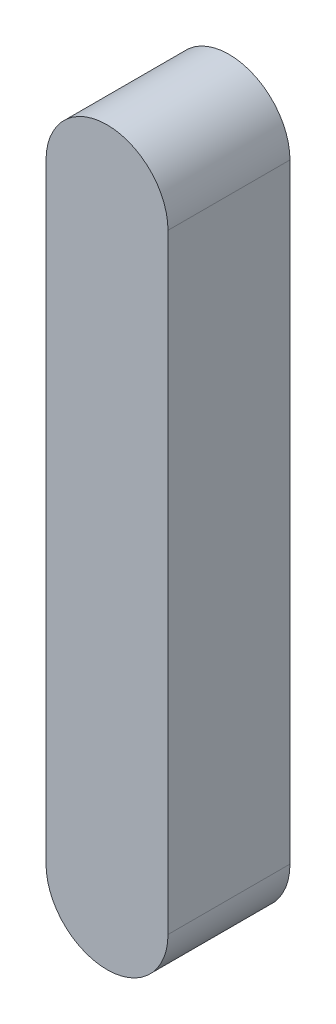
ISO-10303-21;
HEADER;
FILE_DESCRIPTION(('STEP AP214'),'2;1');
FILE_NAME('part.step','',(''),(''),'','','');
FILE_SCHEMA(('AUTOMOTIVE_DESIGN { 1 0 10303 214 1 1 1 1 }'));
ENDSEC;
DATA;
#1=APPLICATION_CONTEXT('core data for automotive mechanical design processes');
#2=APPLICATION_PROTOCOL_DEFINITION('international standard','automotive_design',2000,#1);
#3=PRODUCT_CONTEXT('',#1,'mechanical');
#4=PRODUCT('Part','Part','',(#3));
#5=PRODUCT_RELATED_PRODUCT_CATEGORY('part','',(#4));
#6=PRODUCT_DEFINITION_FORMATION('','',#4);
#7=PRODUCT_DEFINITION_CONTEXT('part definition',#1,'design');
#8=PRODUCT_DEFINITION('design','',#6,#7);
#9=PRODUCT_DEFINITION_SHAPE('','',#8);
#10=(LENGTH_UNIT() NAMED_UNIT(*) SI_UNIT(.MILLI.,.METRE.));
#11=(NAMED_UNIT(*) PLANE_ANGLE_UNIT() SI_UNIT($,.RADIAN.));
#12=(NAMED_UNIT(*) SI_UNIT($,.STERADIAN.) SOLID_ANGLE_UNIT());
#13=UNCERTAINTY_MEASURE_WITH_UNIT(LENGTH_MEASURE(1.E-05),#10,'distance_accuracy_value','');
#14=(GEOMETRIC_REPRESENTATION_CONTEXT(3) GLOBAL_UNCERTAINTY_ASSIGNED_CONTEXT((#13)) GLOBAL_UNIT_ASSIGNED_CONTEXT((#10,
#11,#12)) REPRESENTATION_CONTEXT('',''));
#15=CARTESIAN_POINT('',(0.,0.,0.));
#16=DIRECTION('',(0.,0.,1.));
#17=DIRECTION('',(1.,0.,0.));
#18=AXIS2_PLACEMENT_3D('',#15,#16,#17);
#19=CARTESIAN_POINT('',(0.,-5.000000033,-1.000000032));
#20=DIRECTION('',(0.,0.,1.));
#21=DIRECTION('',(1.,0.,0.));
#22=AXIS2_PLACEMENT_3D('',#19,#20,#21);
#23=PLANE('',#22);
#24=CARTESIAN_POINT('',(0.,-5.000000033,-1.000000032));
#25=DIRECTION('',(0.,0.,1.));
#26=DIRECTION('',(1.,0.,0.));
#27=AXIS2_PLACEMENT_3D('',#24,#25,#26);
#28=CIRCLE('',#27,1.000000032);
#29=CARTESIAN_POINT('',(-1.000000032,-5.000000033,-1.000000032));
#30=VERTEX_POINT('',#29);
#31=CARTESIAN_POINT('',(1.000000032,-5.000000033,-1.000000032));
#32=VERTEX_POINT('',#31);
#33=EDGE_CURVE('E115',#30,#32,#28,.T.);
#34=ORIENTED_EDGE('',*,*,#33,.F.);
#35=DIRECTION('',(0.,-1.,0.));
#36=VECTOR('',#35,1.);
#37=CARTESIAN_POINT('',(-1.000000032,-5.000000033,-1.000000032));
#38=LINE('',#37,#36);
#39=CARTESIAN_POINT('',(-1.000000032,5.000000033,-1.000000032));
#40=VERTEX_POINT('',#39);
#41=EDGE_CURVE('E26',#40,#30,#38,.T.);
#42=ORIENTED_EDGE('',*,*,#41,.F.);
#43=CARTESIAN_POINT('',(0.,5.000000033,-1.000000032));
#44=DIRECTION('',(0.,0.,1.));
#45=DIRECTION('',(1.,0.,0.));
#46=AXIS2_PLACEMENT_3D('',#43,#44,#45);
#47=CIRCLE('',#46,1.000000032);
#48=CARTESIAN_POINT('',(1.000000032,5.000000033,-1.000000032));
#49=VERTEX_POINT('',#48);
#50=EDGE_CURVE('E19',#49,#40,#47,.T.);
#51=ORIENTED_EDGE('',*,*,#50,.F.);
#52=DIRECTION('',(0.,1.,0.));
#53=VECTOR('',#52,1.);
#54=CARTESIAN_POINT('',(1.000000032,-5.000000033,-1.000000032));
#55=LINE('',#54,#53);
#56=EDGE_CURVE('E92',#32,#49,#55,.T.);
#57=ORIENTED_EDGE('',*,*,#56,.F.);
#58=EDGE_LOOP('',(#34,#42,#51,#57));
#59=FACE_BOUND('',#58,.T.);
#60=ADVANCED_FACE('F16',(#59),#23,.F.);
#61=CARTESIAN_POINT('',(0.,-5.000000033,1.000000032));
#62=DIRECTION('',(0.,0.,1.));
#63=DIRECTION('',(1.,0.,0.));
#64=AXIS2_PLACEMENT_3D('',#61,#62,#63);
#65=PLANE('',#64);
#66=CARTESIAN_POINT('',(0.,-5.000000033,1.000000032));
#67=DIRECTION('',(0.,0.,1.));
#68=DIRECTION('',(1.,0.,0.));
#69=AXIS2_PLACEMENT_3D('',#66,#67,#68);
#70=CIRCLE('',#69,1.000000032);
#71=CARTESIAN_POINT('',(-1.000000032,-5.000000033,1.000000032));
#72=VERTEX_POINT('',#71);
#73=CARTESIAN_POINT('',(1.000000032,-5.000000033,1.000000032));
#74=VERTEX_POINT('',#73);
#75=EDGE_CURVE('E87',#72,#74,#70,.T.);
#76=ORIENTED_EDGE('',*,*,#75,.T.);
#77=DIRECTION('',(0.,1.,0.));
#78=VECTOR('',#77,1.);
#79=CARTESIAN_POINT('',(1.000000032,-5.000000033,1.000000032));
#80=LINE('',#79,#78);
#81=CARTESIAN_POINT('',(1.000000032,5.000000033,1.000000032));
#82=VERTEX_POINT('',#81);
#83=EDGE_CURVE('E67',#74,#82,#80,.T.);
#84=ORIENTED_EDGE('',*,*,#83,.T.);
#85=CARTESIAN_POINT('',(0.,5.000000033,1.000000032));
#86=DIRECTION('',(0.,0.,1.));
#87=DIRECTION('',(1.,0.,0.));
#88=AXIS2_PLACEMENT_3D('',#85,#86,#87);
#89=CIRCLE('',#88,1.000000032);
#90=CARTESIAN_POINT('',(-1.000000032,5.000000033,1.000000032));
#91=VERTEX_POINT('',#90);
#92=EDGE_CURVE('E77',#82,#91,#89,.T.);
#93=ORIENTED_EDGE('',*,*,#92,.T.);
#94=DIRECTION('',(0.,-1.,0.));
#95=VECTOR('',#94,1.);
#96=CARTESIAN_POINT('',(-1.000000032,-5.000000033,1.000000032));
#97=LINE('',#96,#95);
#98=EDGE_CURVE('E11',#91,#72,#97,.T.);
#99=ORIENTED_EDGE('',*,*,#98,.T.);
#100=EDGE_LOOP('',(#76,#84,#93,#99));
#101=FACE_BOUND('',#100,.T.);
#102=ADVANCED_FACE('F85',(#101),#65,.T.);
#103=CARTESIAN_POINT('',(-1.000000032,-5.000000033,1.000000032));
#104=DIRECTION('',(1.,0.,0.));
#105=DIRECTION('',(0.,1.,0.));
#106=AXIS2_PLACEMENT_3D('',#103,#104,#105);
#107=PLANE('',#106);
#108=ORIENTED_EDGE('',*,*,#41,.T.);
#109=DIRECTION('',(0.,0.,-1.));
#110=VECTOR('',#109,1.);
#111=CARTESIAN_POINT('',(-1.000000032,-5.000000033,1.000000032));
#112=LINE('',#111,#110);
#113=EDGE_CURVE('E99',#72,#30,#112,.T.);
#114=ORIENTED_EDGE('',*,*,#113,.F.);
#115=ORIENTED_EDGE('',*,*,#98,.F.);
#116=DIRECTION('',(0.,0.,-1.));
#117=VECTOR('',#116,1.);
#118=CARTESIAN_POINT('',(-1.000000032,5.000000033,1.000000032));
#119=LINE('',#118,#117);
#120=EDGE_CURVE('E82',#91,#40,#119,.T.);
#121=ORIENTED_EDGE('',*,*,#120,.T.);
#122=EDGE_LOOP('',(#108,#114,#115,#121));
#123=FACE_BOUND('',#122,.T.);
#124=ADVANCED_FACE('F108',(#123),#107,.F.);
#125=CARTESIAN_POINT('',(0.,5.000000033,1.000000032));
#126=DIRECTION('',(0.,0.,-1.));
#127=DIRECTION('',(-1.,0.,0.));
#128=AXIS2_PLACEMENT_3D('',#125,#126,#127);
#129=CYLINDRICAL_SURFACE('',#128,1.000000032);
#130=ORIENTED_EDGE('',*,*,#50,.T.);
#131=ORIENTED_EDGE('',*,*,#120,.F.);
#132=ORIENTED_EDGE('',*,*,#92,.F.);
#133=DIRECTION('',(0.,0.,-1.));
#134=VECTOR('',#133,1.);
#135=CARTESIAN_POINT('',(1.000000032,5.000000033,1.000000032));
#136=LINE('',#135,#134);
#137=EDGE_CURVE('E80',#82,#49,#136,.T.);
#138=ORIENTED_EDGE('',*,*,#137,.T.);
#139=EDGE_LOOP('',(#130,#131,#132,#138));
#140=FACE_BOUND('',#139,.T.);
#141=ADVANCED_FACE('F79',(#140),#129,.T.);
#142=CARTESIAN_POINT('',(1.000000032,-5.000000033,1.000000032));
#143=DIRECTION('',(-1.,0.,0.));
#144=DIRECTION('',(0.,1.,0.));
#145=AXIS2_PLACEMENT_3D('',#142,#143,#144);
#146=PLANE('',#145);
#147=ORIENTED_EDGE('',*,*,#56,.T.);
#148=ORIENTED_EDGE('',*,*,#137,.F.);
#149=ORIENTED_EDGE('',*,*,#83,.F.);
#150=DIRECTION('',(0.,0.,-1.));
#151=VECTOR('',#150,1.);
#152=CARTESIAN_POINT('',(1.000000032,-5.000000033,1.000000032));
#153=LINE('',#152,#151);
#154=EDGE_CURVE('E119',#74,#32,#153,.T.);
#155=ORIENTED_EDGE('',*,*,#154,.T.);
#156=EDGE_LOOP('',(#147,#148,#149,#155));
#157=FACE_BOUND('',#156,.T.);
#158=ADVANCED_FACE('F91',(#157),#146,.F.);
#159=CARTESIAN_POINT('',(0.,-5.000000033,1.000000032));
#160=DIRECTION('',(0.,0.,-1.));
#161=DIRECTION('',(-1.,0.,0.));
#162=AXIS2_PLACEMENT_3D('',#159,#160,#161);
#163=CYLINDRICAL_SURFACE('',#162,1.000000032);
#164=ORIENTED_EDGE('',*,*,#33,.T.);
#165=ORIENTED_EDGE('',*,*,#154,.F.);
#166=ORIENTED_EDGE('',*,*,#75,.F.);
#167=ORIENTED_EDGE('',*,*,#113,.T.);
#168=EDGE_LOOP('',(#164,#165,#166,#167));
#169=FACE_BOUND('',#168,.T.);
#170=ADVANCED_FACE('F114',(#169),#163,.T.);
#171=CLOSED_SHELL('',(#60,#102,#124,#141,#158,#170));
#172=MANIFOLD_SOLID_BREP('B1',#171);
#173=ADVANCED_BREP_SHAPE_REPRESENTATION('',(#18,#172),#14);
#174=SHAPE_DEFINITION_REPRESENTATION(#9,#173);
ENDSEC;
END-ISO-10303-21;
